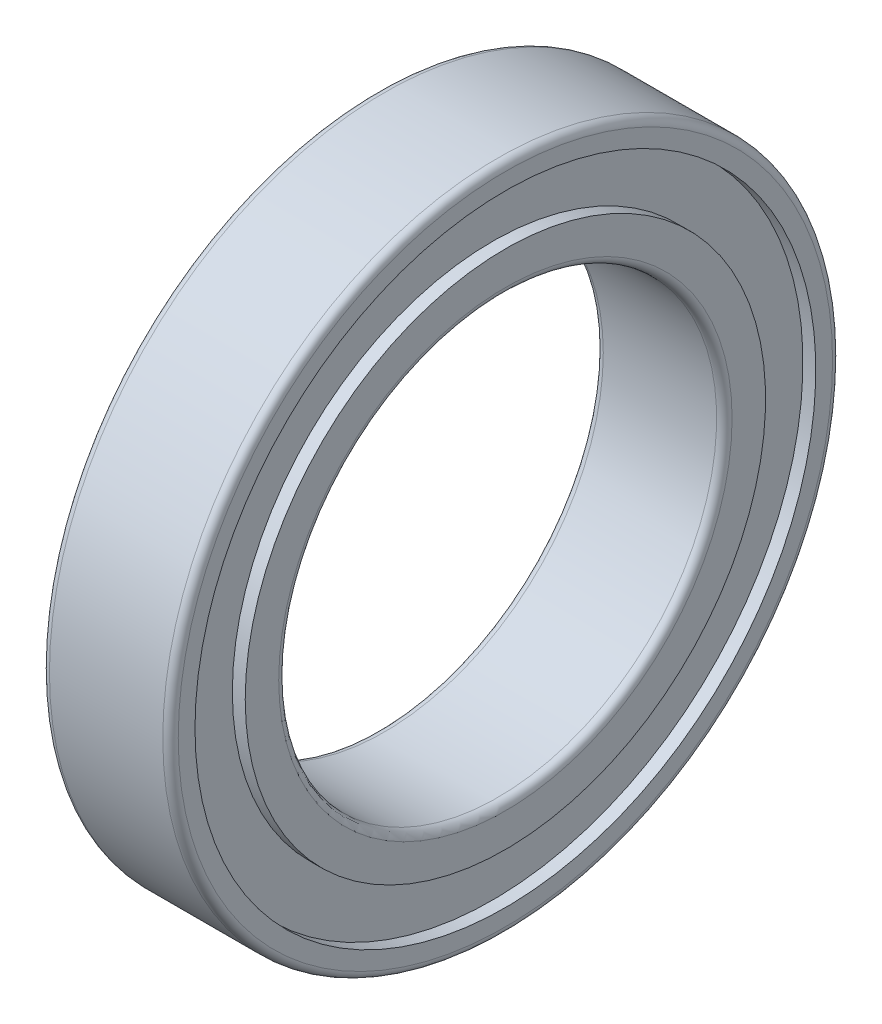
ISO-10303-21;
HEADER;
FILE_DESCRIPTION(('STEP AP214'),'2;1');
FILE_NAME('part.step','',(''),(''),'','','');
FILE_SCHEMA(('AUTOMOTIVE_DESIGN { 1 0 10303 214 1 1 1 1 }'));
ENDSEC;
DATA;
#1=APPLICATION_CONTEXT('core data for automotive mechanical design processes');
#2=APPLICATION_PROTOCOL_DEFINITION('international standard','automotive_design',2000,#1);
#3=PRODUCT_CONTEXT('',#1,'mechanical');
#4=PRODUCT('Part','Part','',(#3));
#5=PRODUCT_RELATED_PRODUCT_CATEGORY('part','',(#4));
#6=PRODUCT_DEFINITION_FORMATION('','',#4);
#7=PRODUCT_DEFINITION_CONTEXT('part definition',#1,'design');
#8=PRODUCT_DEFINITION('design','',#6,#7);
#9=PRODUCT_DEFINITION_SHAPE('','',#8);
#10=(LENGTH_UNIT() NAMED_UNIT(*) SI_UNIT(.MILLI.,.METRE.));
#11=(NAMED_UNIT(*) PLANE_ANGLE_UNIT() SI_UNIT($,.RADIAN.));
#12=(NAMED_UNIT(*) SI_UNIT($,.STERADIAN.) SOLID_ANGLE_UNIT());
#13=UNCERTAINTY_MEASURE_WITH_UNIT(LENGTH_MEASURE(1.E-05),#10,'distance_accuracy_value','');
#14=(GEOMETRIC_REPRESENTATION_CONTEXT(3) GLOBAL_UNCERTAINTY_ASSIGNED_CONTEXT((#13)) GLOBAL_UNIT_ASSIGNED_CONTEXT((#10,
#11,#12)) REPRESENTATION_CONTEXT('',''));
#15=CARTESIAN_POINT('',(0.,0.,0.));
#16=DIRECTION('',(0.,0.,1.));
#17=DIRECTION('',(1.,0.,0.));
#18=AXIS2_PLACEMENT_3D('',#15,#16,#17);
#19=CARTESIAN_POINT('',(0.,0.,0.));
#20=DIRECTION('',(-1.,0.,0.));
#21=DIRECTION('',(0.,0.,1.));
#22=AXIS2_PLACEMENT_3D('',#19,#20,#21);
#23=CYLINDRICAL_SURFACE('',#22,8.5);
#24=CARTESIAN_POINT('',(4.7,0.,0.));
#25=DIRECTION('',(-1.,0.,0.));
#26=DIRECTION('',(0.,0.,1.));
#27=AXIS2_PLACEMENT_3D('',#24,#25,#26);
#28=CIRCLE('',#27,8.5);
#29=CARTESIAN_POINT('',(4.7,0.,8.5));
#30=VERTEX_POINT('',#29);
#31=EDGE_CURVE('E262',#30,#30,#28,.T.);
#32=ORIENTED_EDGE('',*,*,#31,.F.);
#33=EDGE_LOOP('',(#32));
#34=FACE_BOUND('',#33,.T.);
#35=CARTESIAN_POINT('',(0.3,0.,0.));
#36=DIRECTION('',(1.,0.,0.));
#37=DIRECTION('',(0.,0.,-1.));
#38=AXIS2_PLACEMENT_3D('',#35,#36,#37);
#39=CIRCLE('',#38,8.5);
#40=CARTESIAN_POINT('',(0.3,0.,-8.5));
#41=VERTEX_POINT('',#40);
#42=EDGE_CURVE('E66',#41,#41,#39,.T.);
#43=ORIENTED_EDGE('',*,*,#42,.F.);
#44=EDGE_LOOP('',(#43));
#45=FACE_BOUND('',#44,.T.);
#46=ADVANCED_FACE('F16',(#34,#45),#23,.F.);
#47=CARTESIAN_POINT('',(4.7,0.,0.));
#48=DIRECTION('',(-1.,0.,0.));
#49=DIRECTION('',(0.,0.,1.));
#50=AXIS2_PLACEMENT_3D('',#47,#48,#49);
#51=TOROIDAL_SURFACE('',#50,8.8,0.3);
#52=CARTESIAN_POINT('',(5.,0.,0.));
#53=DIRECTION('',(1.,0.,0.));
#54=DIRECTION('',(0.,0.,1.));
#55=AXIS2_PLACEMENT_3D('',#52,#53,#54);
#56=CIRCLE('',#55,8.8);
#57=CARTESIAN_POINT('',(5.,0.,8.8));
#58=VERTEX_POINT('',#57);
#59=CARTESIAN_POINT('',(5.,0.,-8.8));
#60=VERTEX_POINT('',#59);
#61=EDGE_CURVE('E60',#58,#60,#56,.T.);
#62=ORIENTED_EDGE('',*,*,#61,.T.);
#63=CARTESIAN_POINT('',(5.,0.,0.));
#64=DIRECTION('',(1.,0.,0.));
#65=DIRECTION('',(0.,0.,-1.));
#66=AXIS2_PLACEMENT_3D('',#63,#64,#65);
#67=CIRCLE('',#66,8.8);
#68=EDGE_CURVE('E57',#60,#58,#67,.T.);
#69=ORIENTED_EDGE('',*,*,#68,.T.);
#70=EDGE_LOOP('',(#62,#69));
#71=FACE_BOUND('',#70,.T.);
#72=ORIENTED_EDGE('',*,*,#31,.T.);
#73=EDGE_LOOP('',(#72));
#74=FACE_BOUND('',#73,.T.);
#75=ADVANCED_FACE('F61',(#71,#74),#51,.T.);
#76=CARTESIAN_POINT('',(0.3,0.,0.));
#77=DIRECTION('',(1.,0.,0.));
#78=DIRECTION('',(0.,0.,-1.));
#79=AXIS2_PLACEMENT_3D('',#76,#77,#78);
#80=TOROIDAL_SURFACE('',#79,8.8,0.3);
#81=CARTESIAN_POINT('',(0.,0.,0.));
#82=DIRECTION('',(-1.,0.,0.));
#83=DIRECTION('',(0.,0.,-1.));
#84=AXIS2_PLACEMENT_3D('',#81,#82,#83);
#85=CIRCLE('',#84,8.8);
#86=CARTESIAN_POINT('',(0.,0.,-8.8));
#87=VERTEX_POINT('',#86);
#88=CARTESIAN_POINT('',(0.,0.,8.8));
#89=VERTEX_POINT('',#88);
#90=EDGE_CURVE('E70',#87,#89,#85,.T.);
#91=ORIENTED_EDGE('',*,*,#90,.T.);
#92=CARTESIAN_POINT('',(0.,0.,0.));
#93=DIRECTION('',(-1.,0.,0.));
#94=DIRECTION('',(0.,0.,1.));
#95=AXIS2_PLACEMENT_3D('',#92,#93,#94);
#96=CIRCLE('',#95,8.8);
#97=EDGE_CURVE('E224',#89,#87,#96,.T.);
#98=ORIENTED_EDGE('',*,*,#97,.T.);
#99=EDGE_LOOP('',(#91,#98));
#100=FACE_BOUND('',#99,.T.);
#101=ORIENTED_EDGE('',*,*,#42,.T.);
#102=EDGE_LOOP('',(#101));
#103=FACE_BOUND('',#102,.T.);
#104=ADVANCED_FACE('F91',(#100,#103),#80,.T.);
#105=CARTESIAN_POINT('',(5.,8.5,0.));
#106=DIRECTION('',(-1.,0.,0.));
#107=DIRECTION('',(0.,0.,1.));
#108=AXIS2_PLACEMENT_3D('',#105,#106,#107);
#109=PLANE('',#108);
#110=CARTESIAN_POINT('',(5.,0.,0.));
#111=DIRECTION('',(-1.,0.,0.));
#112=DIRECTION('',(0.,0.,1.));
#113=AXIS2_PLACEMENT_3D('',#110,#111,#112);
#114=CIRCLE('',#113,10.1);
#115=CARTESIAN_POINT('',(5.,0.,10.1));
#116=VERTEX_POINT('',#115);
#117=EDGE_CURVE('E233',#116,#116,#114,.T.);
#118=ORIENTED_EDGE('',*,*,#117,.F.);
#119=EDGE_LOOP('',(#118));
#120=FACE_BOUND('',#119,.T.);
#121=ORIENTED_EDGE('',*,*,#61,.F.);
#122=ORIENTED_EDGE('',*,*,#68,.F.);
#123=EDGE_LOOP('',(#121,#122));
#124=FACE_BOUND('',#123,.T.);
#125=ADVANCED_FACE('F69',(#120,#124),#109,.F.);
#126=CARTESIAN_POINT('',(0.,8.5,0.));
#127=DIRECTION('',(1.,0.,0.));
#128=DIRECTION('',(0.,0.,-1.));
#129=AXIS2_PLACEMENT_3D('',#126,#127,#128);
#130=PLANE('',#129);
#131=CARTESIAN_POINT('',(0.,0.,0.));
#132=DIRECTION('',(-1.,0.,0.));
#133=DIRECTION('',(0.,0.,1.));
#134=AXIS2_PLACEMENT_3D('',#131,#132,#133);
#135=CIRCLE('',#134,10.1);
#136=CARTESIAN_POINT('',(0.,0.,10.1));
#137=VERTEX_POINT('',#136);
#138=EDGE_CURVE('E238',#137,#137,#135,.F.);
#139=ORIENTED_EDGE('',*,*,#138,.F.);
#140=EDGE_LOOP('',(#139));
#141=FACE_BOUND('',#140,.T.);
#142=ORIENTED_EDGE('',*,*,#90,.F.);
#143=ORIENTED_EDGE('',*,*,#97,.F.);
#144=EDGE_LOOP('',(#142,#143));
#145=FACE_BOUND('',#144,.T.);
#146=ADVANCED_FACE('F90',(#141,#145),#130,.F.);
#147=CARTESIAN_POINT('',(0.,0.,0.));
#148=DIRECTION('',(-1.,0.,0.));
#149=DIRECTION('',(0.,0.,1.));
#150=AXIS2_PLACEMENT_3D('',#147,#148,#149);
#151=CYLINDRICAL_SURFACE('',#150,10.1);
#152=CARTESIAN_POINT('',(4.5,0.,0.));
#153=DIRECTION('',(-1.,0.,0.));
#154=DIRECTION('',(0.,0.,1.));
#155=AXIS2_PLACEMENT_3D('',#152,#153,#154);
#156=CIRCLE('',#155,10.1);
#157=CARTESIAN_POINT('',(4.5,0.,10.1));
#158=VERTEX_POINT('',#157);
#159=EDGE_CURVE('E248',#158,#158,#156,.F.);
#160=ORIENTED_EDGE('',*,*,#159,.T.);
#161=EDGE_LOOP('',(#160));
#162=FACE_BOUND('',#161,.T.);
#163=ORIENTED_EDGE('',*,*,#117,.T.);
#164=EDGE_LOOP('',(#163));
#165=FACE_BOUND('',#164,.T.);
#166=ADVANCED_FACE('F332',(#162,#165),#151,.T.);
#167=CARTESIAN_POINT('',(0.,0.,0.));
#168=DIRECTION('',(-1.,0.,0.));
#169=DIRECTION('',(0.,0.,1.));
#170=AXIS2_PLACEMENT_3D('',#167,#168,#169);
#171=CYLINDRICAL_SURFACE('',#170,10.1);
#172=ORIENTED_EDGE('',*,*,#138,.T.);
#173=EDGE_LOOP('',(#172));
#174=FACE_BOUND('',#173,.T.);
#175=CARTESIAN_POINT('',(0.5,0.,0.));
#176=DIRECTION('',(-1.,0.,0.));
#177=DIRECTION('',(0.,0.,1.));
#178=AXIS2_PLACEMENT_3D('',#175,#176,#177);
#179=CIRCLE('',#178,10.1);
#180=CARTESIAN_POINT('',(0.5,0.,10.1));
#181=VERTEX_POINT('',#180);
#182=EDGE_CURVE('E245',#181,#181,#179,.T.);
#183=ORIENTED_EDGE('',*,*,#182,.T.);
#184=EDGE_LOOP('',(#183));
#185=FACE_BOUND('',#184,.T.);
#186=ADVANCED_FACE('F299',(#174,#185),#171,.T.);
#187=CARTESIAN_POINT('',(4.5,12.05,0.));
#188=DIRECTION('',(-1.,0.,0.));
#189=DIRECTION('',(0.,0.,1.));
#190=AXIS2_PLACEMENT_3D('',#187,#188,#189);
#191=PLANE('',#190);
#192=ORIENTED_EDGE('',*,*,#159,.F.);
#193=EDGE_LOOP('',(#192));
#194=FACE_BOUND('',#193,.T.);
#195=CARTESIAN_POINT('',(4.5,0.,0.));
#196=DIRECTION('',(-1.,0.,0.));
#197=DIRECTION('',(0.,0.,1.));
#198=AXIS2_PLACEMENT_3D('',#195,#196,#197);
#199=CIRCLE('',#198,12.05);
#200=CARTESIAN_POINT('',(4.5,0.,12.05));
#201=VERTEX_POINT('',#200);
#202=EDGE_CURVE('E247',#201,#201,#199,.F.);
#203=ORIENTED_EDGE('',*,*,#202,.T.);
#204=EDGE_LOOP('',(#203));
#205=FACE_BOUND('',#204,.T.);
#206=ADVANCED_FACE('F295',(#194,#205),#191,.F.);
#207=CARTESIAN_POINT('',(0.5,10.1,0.));
#208=DIRECTION('',(1.,0.,0.));
#209=DIRECTION('',(0.,0.,-1.));
#210=AXIS2_PLACEMENT_3D('',#207,#208,#209);
#211=PLANE('',#210);
#212=CARTESIAN_POINT('',(0.5,0.,0.));
#213=DIRECTION('',(-1.,0.,0.));
#214=DIRECTION('',(0.,0.,1.));
#215=AXIS2_PLACEMENT_3D('',#212,#213,#214);
#216=CIRCLE('',#215,12.05);
#217=CARTESIAN_POINT('',(0.5,0.,12.05));
#218=VERTEX_POINT('',#217);
#219=EDGE_CURVE('E258',#218,#218,#216,.T.);
#220=ORIENTED_EDGE('',*,*,#219,.T.);
#221=EDGE_LOOP('',(#220));
#222=FACE_BOUND('',#221,.T.);
#223=ORIENTED_EDGE('',*,*,#182,.F.);
#224=EDGE_LOOP('',(#223));
#225=FACE_BOUND('',#224,.T.);
#226=ADVANCED_FACE('F298',(#222,#225),#211,.F.);
#227=CARTESIAN_POINT('',(0.,0.,0.));
#228=DIRECTION('',(-1.,0.,0.));
#229=DIRECTION('',(0.,0.,1.));
#230=AXIS2_PLACEMENT_3D('',#227,#228,#229);
#231=CYLINDRICAL_SURFACE('',#230,12.05);
#232=CARTESIAN_POINT('',(5.,0.,0.));
#233=DIRECTION('',(-1.,0.,0.));
#234=DIRECTION('',(0.,0.,1.));
#235=AXIS2_PLACEMENT_3D('',#232,#233,#234);
#236=CIRCLE('',#235,12.05);
#237=CARTESIAN_POINT('',(5.,0.,12.05));
#238=VERTEX_POINT('',#237);
#239=EDGE_CURVE('E255',#238,#238,#236,.F.);
#240=ORIENTED_EDGE('',*,*,#239,.T.);
#241=EDGE_LOOP('',(#240));
#242=FACE_BOUND('',#241,.T.);
#243=ORIENTED_EDGE('',*,*,#202,.F.);
#244=EDGE_LOOP('',(#243));
#245=FACE_BOUND('',#244,.T.);
#246=ADVANCED_FACE('F360',(#242,#245),#231,.F.);
#247=CARTESIAN_POINT('',(0.,0.,0.));
#248=DIRECTION('',(-1.,0.,0.));
#249=DIRECTION('',(0.,0.,1.));
#250=AXIS2_PLACEMENT_3D('',#247,#248,#249);
#251=CYLINDRICAL_SURFACE('',#250,12.05);
#252=ORIENTED_EDGE('',*,*,#219,.F.);
#253=EDGE_LOOP('',(#252));
#254=FACE_BOUND('',#253,.T.);
#255=CARTESIAN_POINT('',(0.,0.,0.));
#256=DIRECTION('',(-1.,0.,0.));
#257=DIRECTION('',(0.,0.,1.));
#258=AXIS2_PLACEMENT_3D('',#255,#256,#257);
#259=CIRCLE('',#258,12.05);
#260=CARTESIAN_POINT('',(0.,0.,12.05));
#261=VERTEX_POINT('',#260);
#262=EDGE_CURVE('E251',#261,#261,#259,.T.);
#263=ORIENTED_EDGE('',*,*,#262,.T.);
#264=EDGE_LOOP('',(#263));
#265=FACE_BOUND('',#264,.T.);
#266=ADVANCED_FACE('F192',(#254,#265),#251,.F.);
#267=CARTESIAN_POINT('',(5.,13.,0.));
#268=DIRECTION('',(-1.,0.,0.));
#269=DIRECTION('',(0.,0.,1.));
#270=AXIS2_PLACEMENT_3D('',#267,#268,#269);
#271=PLANE('',#270);
#272=ORIENTED_EDGE('',*,*,#239,.F.);
#273=EDGE_LOOP('',(#272));
#274=FACE_BOUND('',#273,.T.);
#275=CARTESIAN_POINT('',(5.,0.,0.));
#276=DIRECTION('',(-1.,0.,0.));
#277=DIRECTION('',(0.,0.,1.));
#278=AXIS2_PLACEMENT_3D('',#275,#276,#277);
#279=CIRCLE('',#278,12.7);
#280=CARTESIAN_POINT('',(5.,0.,12.7));
#281=VERTEX_POINT('',#280);
#282=CARTESIAN_POINT('',(5.,0.,-12.7));
#283=VERTEX_POINT('',#282);
#284=EDGE_CURVE('E178',#281,#283,#279,.T.);
#285=ORIENTED_EDGE('',*,*,#284,.F.);
#286=CARTESIAN_POINT('',(5.,0.,0.));
#287=DIRECTION('',(-1.,0.,0.));
#288=DIRECTION('',(0.,0.,-1.));
#289=AXIS2_PLACEMENT_3D('',#286,#287,#288);
#290=CIRCLE('',#289,12.7);
#291=EDGE_CURVE('E254',#283,#281,#290,.T.);
#292=ORIENTED_EDGE('',*,*,#291,.F.);
#293=EDGE_LOOP('',(#285,#292));
#294=FACE_BOUND('',#293,.T.);
#295=ADVANCED_FACE('F183',(#274,#294),#271,.F.);
#296=CARTESIAN_POINT('',(0.,12.05,0.));
#297=DIRECTION('',(1.,0.,0.));
#298=DIRECTION('',(0.,0.,-1.));
#299=AXIS2_PLACEMENT_3D('',#296,#297,#298);
#300=PLANE('',#299);
#301=ORIENTED_EDGE('',*,*,#262,.F.);
#302=EDGE_LOOP('',(#301));
#303=FACE_BOUND('',#302,.T.);
#304=CARTESIAN_POINT('',(0.,0.,0.));
#305=DIRECTION('',(1.,0.,0.));
#306=DIRECTION('',(0.,0.,-1.));
#307=AXIS2_PLACEMENT_3D('',#304,#305,#306);
#308=CIRCLE('',#307,12.7);
#309=CARTESIAN_POINT('',(0.,0.,-12.7));
#310=VERTEX_POINT('',#309);
#311=CARTESIAN_POINT('',(0.,0.,12.7));
#312=VERTEX_POINT('',#311);
#313=EDGE_CURVE('E148',#310,#312,#308,.T.);
#314=ORIENTED_EDGE('',*,*,#313,.F.);
#315=CARTESIAN_POINT('',(0.,0.,0.));
#316=DIRECTION('',(1.,0.,0.));
#317=DIRECTION('',(0.,0.,1.));
#318=AXIS2_PLACEMENT_3D('',#315,#316,#317);
#319=CIRCLE('',#318,12.7);
#320=EDGE_CURVE('E35',#312,#310,#319,.T.);
#321=ORIENTED_EDGE('',*,*,#320,.F.);
#322=EDGE_LOOP('',(#314,#321));
#323=FACE_BOUND('',#322,.T.);
#324=ADVANCED_FACE('F134',(#303,#323),#300,.F.);
#325=CARTESIAN_POINT('',(4.7,0.,0.));
#326=DIRECTION('',(-1.,0.,0.));
#327=DIRECTION('',(0.,0.,1.));
#328=AXIS2_PLACEMENT_3D('',#325,#326,#327);
#329=TOROIDAL_SURFACE('',#328,12.7,0.3);
#330=CARTESIAN_POINT('',(4.7,0.,0.));
#331=DIRECTION('',(-1.,0.,0.));
#332=DIRECTION('',(0.,0.,1.));
#333=AXIS2_PLACEMENT_3D('',#330,#331,#332);
#334=CIRCLE('',#333,13.);
#335=CARTESIAN_POINT('',(4.7,0.,13.));
#336=VERTEX_POINT('',#335);
#337=EDGE_CURVE('E27',#336,#336,#334,.T.);
#338=ORIENTED_EDGE('',*,*,#337,.F.);
#339=EDGE_LOOP('',(#338));
#340=FACE_BOUND('',#339,.T.);
#341=ORIENTED_EDGE('',*,*,#284,.T.);
#342=ORIENTED_EDGE('',*,*,#291,.T.);
#343=EDGE_LOOP('',(#341,#342));
#344=FACE_BOUND('',#343,.T.);
#345=ADVANCED_FACE('F122',(#340,#344),#329,.T.);
#346=CARTESIAN_POINT('',(0.3,0.,0.));
#347=DIRECTION('',(1.,0.,0.));
#348=DIRECTION('',(0.,0.,-1.));
#349=AXIS2_PLACEMENT_3D('',#346,#347,#348);
#350=TOROIDAL_SURFACE('',#349,12.7,0.3);
#351=CARTESIAN_POINT('',(0.3,0.,0.));
#352=DIRECTION('',(-1.,0.,0.));
#353=DIRECTION('',(0.,0.,1.));
#354=AXIS2_PLACEMENT_3D('',#351,#352,#353);
#355=CIRCLE('',#354,13.);
#356=CARTESIAN_POINT('',(0.3,0.,13.));
#357=VERTEX_POINT('',#356);
#358=EDGE_CURVE('E11',#357,#357,#355,.F.);
#359=ORIENTED_EDGE('',*,*,#358,.F.);
#360=EDGE_LOOP('',(#359));
#361=FACE_BOUND('',#360,.T.);
#362=ORIENTED_EDGE('',*,*,#313,.T.);
#363=ORIENTED_EDGE('',*,*,#320,.T.);
#364=EDGE_LOOP('',(#362,#363));
#365=FACE_BOUND('',#364,.T.);
#366=ADVANCED_FACE('F133',(#361,#365),#350,.T.);
#367=CARTESIAN_POINT('',(0.,0.,0.));
#368=DIRECTION('',(-1.,0.,0.));
#369=DIRECTION('',(0.,0.,1.));
#370=AXIS2_PLACEMENT_3D('',#367,#368,#369);
#371=CYLINDRICAL_SURFACE('',#370,13.);
#372=ORIENTED_EDGE('',*,*,#358,.T.);
#373=EDGE_LOOP('',(#372));
#374=FACE_BOUND('',#373,.T.);
#375=ORIENTED_EDGE('',*,*,#337,.T.);
#376=EDGE_LOOP('',(#375));
#377=FACE_BOUND('',#376,.T.);
#378=ADVANCED_FACE('F280',(#374,#377),#371,.T.);
#379=CLOSED_SHELL('',(#46,#75,#104,#125,#146,#166,#186,#206,#226,#246,#266,#295,#324,#345,#366,#378));
#380=MANIFOLD_SOLID_BREP('B1',#379);
#381=ADVANCED_BREP_SHAPE_REPRESENTATION('',(#18,#380),#14);
#382=SHAPE_DEFINITION_REPRESENTATION(#9,#381);
ENDSEC;
END-ISO-10303-21;
